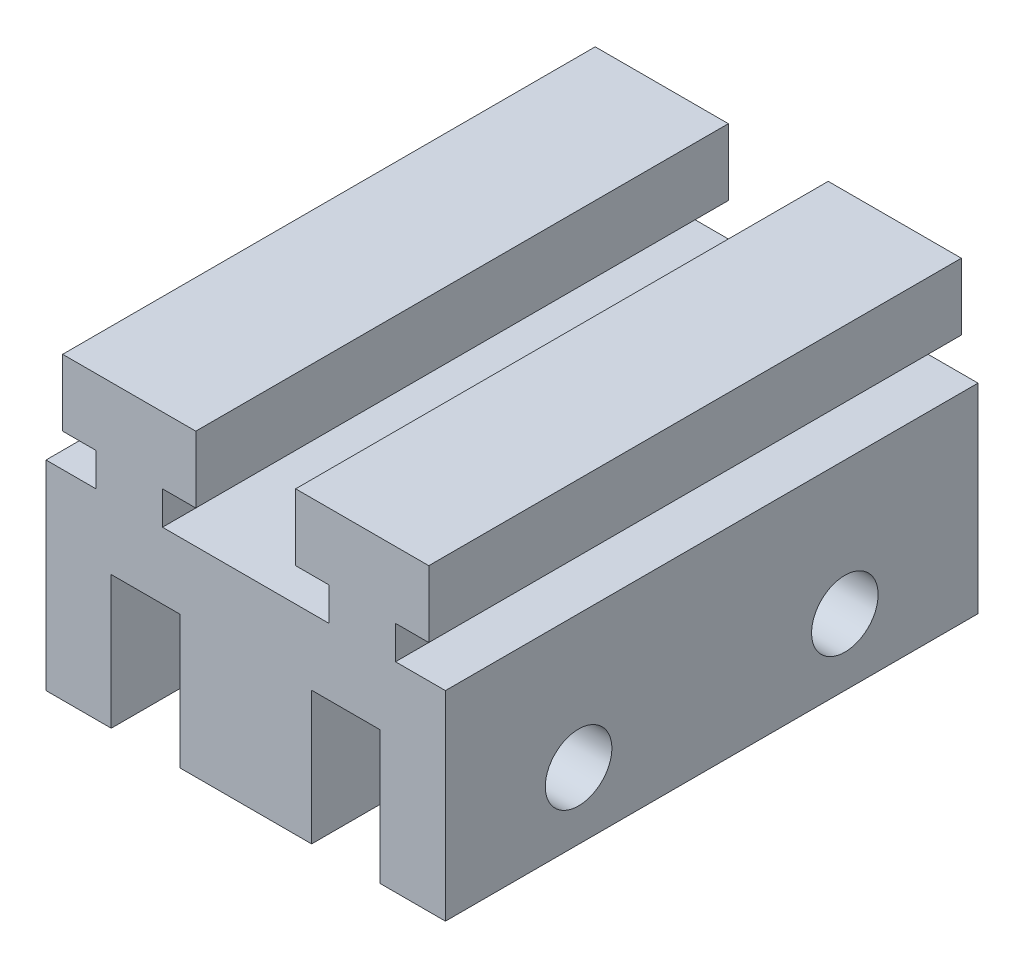
ISO-10303-21;
HEADER;
FILE_DESCRIPTION(('STEP AP214'),'2;1');
FILE_NAME('part.step','',(''),(''),'','','');
FILE_SCHEMA(('AUTOMOTIVE_DESIGN { 1 0 10303 214 1 1 1 1 }'));
ENDSEC;
DATA;
#1=APPLICATION_CONTEXT('core data for automotive mechanical design processes');
#2=APPLICATION_PROTOCOL_DEFINITION('international standard','automotive_design',2000,#1);
#3=PRODUCT_CONTEXT('',#1,'mechanical');
#4=PRODUCT('Part','Part','',(#3));
#5=PRODUCT_RELATED_PRODUCT_CATEGORY('part','',(#4));
#6=PRODUCT_DEFINITION_FORMATION('','',#4);
#7=PRODUCT_DEFINITION_CONTEXT('part definition',#1,'design');
#8=PRODUCT_DEFINITION('design','',#6,#7);
#9=PRODUCT_DEFINITION_SHAPE('','',#8);
#10=(LENGTH_UNIT() NAMED_UNIT(*) SI_UNIT(.MILLI.,.METRE.));
#11=(NAMED_UNIT(*) PLANE_ANGLE_UNIT() SI_UNIT($,.RADIAN.));
#12=(NAMED_UNIT(*) SI_UNIT($,.STERADIAN.) SOLID_ANGLE_UNIT());
#13=UNCERTAINTY_MEASURE_WITH_UNIT(LENGTH_MEASURE(1.E-05),#10,'distance_accuracy_value','');
#14=(GEOMETRIC_REPRESENTATION_CONTEXT(3) GLOBAL_UNCERTAINTY_ASSIGNED_CONTEXT((#13)) GLOBAL_UNIT_ASSIGNED_CONTEXT((#10,
#11,#12)) REPRESENTATION_CONTEXT('',''));
#15=CARTESIAN_POINT('',(0.,0.,0.));
#16=DIRECTION('',(0.,0.,1.));
#17=DIRECTION('',(1.,0.,0.));
#18=AXIS2_PLACEMENT_3D('',#15,#16,#17);
#19=CARTESIAN_POINT('',(0.,15.,0.));
#20=DIRECTION('',(0.,1.,0.));
#21=DIRECTION('',(0.,0.,1.));
#22=AXIS2_PLACEMENT_3D('',#19,#20,#21);
#23=PLANE('',#22);
#24=DIRECTION('',(-1.,0.,0.));
#25=VECTOR('',#24,1.);
#26=CARTESIAN_POINT('',(-15.,15.,-20.));
#27=LINE('',#26,#25);
#28=CARTESIAN_POINT('',(15.,15.,-20.));
#29=VERTEX_POINT('',#28);
#30=CARTESIAN_POINT('',(11.25,15.,-20.));
#31=VERTEX_POINT('',#30);
#32=EDGE_CURVE('E488',#29,#31,#27,.T.);
#33=ORIENTED_EDGE('',*,*,#32,.T.);
#34=DIRECTION('',(0.,0.,1.));
#35=VECTOR('',#34,1.);
#36=CARTESIAN_POINT('',(11.25,15.,-32.5));
#37=LINE('',#36,#35);
#38=CARTESIAN_POINT('',(11.25,15.,20.));
#39=VERTEX_POINT('',#38);
#40=EDGE_CURVE('E61',#31,#39,#37,.T.);
#41=ORIENTED_EDGE('',*,*,#40,.T.);
#42=DIRECTION('',(1.,0.,0.));
#43=VECTOR('',#42,1.);
#44=CARTESIAN_POINT('',(-15.,15.,20.));
#45=LINE('',#44,#43);
#46=CARTESIAN_POINT('',(15.,15.,20.));
#47=VERTEX_POINT('',#46);
#48=EDGE_CURVE('E257',#39,#47,#45,.T.);
#49=ORIENTED_EDGE('',*,*,#48,.T.);
#50=DIRECTION('',(0.,0.,-1.));
#51=VECTOR('',#50,1.);
#52=CARTESIAN_POINT('',(15.,15.,-20.));
#53=LINE('',#52,#51);
#54=EDGE_CURVE('E484',#47,#29,#53,.T.);
#55=ORIENTED_EDGE('',*,*,#54,.T.);
#56=EDGE_LOOP('',(#33,#41,#49,#55));
#57=FACE_BOUND('',#56,.T.);
#58=ADVANCED_FACE('F43',(#57),#23,.T.);
#59=CARTESIAN_POINT('',(-6.25,15.,20.));
#60=VERTEX_POINT('',#59);
#61=CARTESIAN_POINT('',(6.25,15.,20.));
#62=VERTEX_POINT('',#61);
#63=EDGE_CURVE('E69',#60,#62,#45,.T.);
#64=ORIENTED_EDGE('',*,*,#63,.T.);
#65=DIRECTION('',(0.,0.,1.));
#66=VECTOR('',#65,1.);
#67=CARTESIAN_POINT('',(6.25,15.,-32.5));
#68=LINE('',#67,#66);
#69=CARTESIAN_POINT('',(6.25,15.,-20.));
#70=VERTEX_POINT('',#69);
#71=EDGE_CURVE('E282',#70,#62,#68,.T.);
#72=ORIENTED_EDGE('',*,*,#71,.F.);
#73=CARTESIAN_POINT('',(-6.25,15.,-20.));
#74=VERTEX_POINT('',#73);
#75=EDGE_CURVE('E492',#70,#74,#27,.T.);
#76=ORIENTED_EDGE('',*,*,#75,.T.);
#77=DIRECTION('',(0.,0.,1.));
#78=VECTOR('',#77,1.);
#79=CARTESIAN_POINT('',(-6.25,15.,-32.5));
#80=LINE('',#79,#78);
#81=EDGE_CURVE('E352',#74,#60,#80,.T.);
#82=ORIENTED_EDGE('',*,*,#81,.T.);
#83=EDGE_LOOP('',(#64,#72,#76,#82));
#84=FACE_BOUND('',#83,.T.);
#85=ADVANCED_FACE('F569',(#84),#23,.T.);
#86=CARTESIAN_POINT('',(0.,10.,0.));
#87=DIRECTION('',(0.,1.,0.));
#88=DIRECTION('',(0.,0.,1.));
#89=AXIS2_PLACEMENT_3D('',#86,#87,#88);
#90=PLANE('',#89);
#91=DIRECTION('',(0.,0.,1.));
#92=VECTOR('',#91,1.);
#93=CARTESIAN_POINT('',(-4.95,10.,-20.));
#94=LINE('',#93,#92);
#95=CARTESIAN_POINT('',(-4.95,10.,-20.));
#96=VERTEX_POINT('',#95);
#97=CARTESIAN_POINT('',(-4.95,10.,20.));
#98=VERTEX_POINT('',#97);
#99=EDGE_CURVE('E410',#96,#98,#94,.T.);
#100=ORIENTED_EDGE('',*,*,#99,.T.);
#101=DIRECTION('',(1.,0.,0.));
#102=VECTOR('',#101,1.);
#103=CARTESIAN_POINT('',(-15.,10.,20.));
#104=LINE('',#103,#102);
#105=CARTESIAN_POINT('',(-10.1,10.,20.));
#106=VERTEX_POINT('',#105);
#107=EDGE_CURVE('E493',#106,#98,#104,.T.);
#108=ORIENTED_EDGE('',*,*,#107,.F.);
#109=DIRECTION('',(0.,0.,-1.));
#110=VECTOR('',#109,1.);
#111=CARTESIAN_POINT('',(-10.1,10.,-20.));
#112=LINE('',#111,#110);
#113=CARTESIAN_POINT('',(-10.1,10.,-20.));
#114=VERTEX_POINT('',#113);
#115=EDGE_CURVE('E515',#106,#114,#112,.T.);
#116=ORIENTED_EDGE('',*,*,#115,.T.);
#117=DIRECTION('',(-1.,0.,0.));
#118=VECTOR('',#117,1.);
#119=CARTESIAN_POINT('',(-15.,10.,-20.));
#120=LINE('',#119,#118);
#121=EDGE_CURVE('E497',#96,#114,#120,.T.);
#122=ORIENTED_EDGE('',*,*,#121,.F.);
#123=EDGE_LOOP('',(#100,#108,#116,#122));
#124=FACE_BOUND('',#123,.T.);
#125=ADVANCED_FACE('F574',(#124),#90,.F.);
#126=DIRECTION('',(0.,0.,-1.));
#127=VECTOR('',#126,1.);
#128=CARTESIAN_POINT('',(4.95,10.,-20.));
#129=LINE('',#128,#127);
#130=CARTESIAN_POINT('',(4.95,10.,20.));
#131=VERTEX_POINT('',#130);
#132=CARTESIAN_POINT('',(4.95,10.,-20.));
#133=VERTEX_POINT('',#132);
#134=EDGE_CURVE('E405',#131,#133,#129,.T.);
#135=ORIENTED_EDGE('',*,*,#134,.T.);
#136=CARTESIAN_POINT('',(10.1,10.,-20.));
#137=VERTEX_POINT('',#136);
#138=EDGE_CURVE('E480',#137,#133,#120,.T.);
#139=ORIENTED_EDGE('',*,*,#138,.F.);
#140=DIRECTION('',(0.,0.,1.));
#141=VECTOR('',#140,1.);
#142=CARTESIAN_POINT('',(10.1,10.,-20.));
#143=LINE('',#142,#141);
#144=CARTESIAN_POINT('',(10.1,10.,20.));
#145=VERTEX_POINT('',#144);
#146=EDGE_CURVE('E456',#137,#145,#143,.T.);
#147=ORIENTED_EDGE('',*,*,#146,.T.);
#148=EDGE_CURVE('E472',#131,#145,#104,.T.);
#149=ORIENTED_EDGE('',*,*,#148,.F.);
#150=EDGE_LOOP('',(#135,#139,#147,#149));
#151=FACE_BOUND('',#150,.T.);
#152=ADVANCED_FACE('F682',(#151),#90,.F.);
#153=CARTESIAN_POINT('',(-15.,10.,-20.));
#154=DIRECTION('',(1.,0.,0.));
#155=DIRECTION('',(0.,0.,-1.));
#156=AXIS2_PLACEMENT_3D('',#153,#154,#155);
#157=PLANE('',#156);
#158=CARTESIAN_POINT('',(-15.,5.,-10.));
#159=DIRECTION('',(-1.,0.,0.));
#160=DIRECTION('',(0.,0.,1.));
#161=AXIS2_PLACEMENT_3D('',#158,#159,#160);
#162=CIRCLE('',#161,2.5);
#163=CARTESIAN_POINT('',(-15.,5.,-7.5));
#164=VERTEX_POINT('',#163);
#165=EDGE_CURVE('E507',#164,#164,#162,.T.);
#166=ORIENTED_EDGE('',*,*,#165,.F.);
#167=EDGE_LOOP('',(#166));
#168=FACE_BOUND('',#167,.T.);
#169=CARTESIAN_POINT('',(-15.,5.,10.));
#170=DIRECTION('',(-1.,0.,0.));
#171=DIRECTION('',(0.,0.,1.));
#172=AXIS2_PLACEMENT_3D('',#169,#170,#171);
#173=CIRCLE('',#172,2.5);
#174=CARTESIAN_POINT('',(-15.,5.,12.5));
#175=VERTEX_POINT('',#174);
#176=EDGE_CURVE('E506',#175,#175,#173,.T.);
#177=ORIENTED_EDGE('',*,*,#176,.F.);
#178=EDGE_LOOP('',(#177));
#179=FACE_BOUND('',#178,.T.);
#180=DIRECTION('',(0.,0.,1.));
#181=VECTOR('',#180,1.);
#182=CARTESIAN_POINT('',(-15.,0.,-20.));
#183=LINE('',#182,#181);
#184=CARTESIAN_POINT('',(-15.,0.,-20.));
#185=VERTEX_POINT('',#184);
#186=CARTESIAN_POINT('',(-15.,0.,20.));
#187=VERTEX_POINT('',#186);
#188=EDGE_CURVE('E521',#185,#187,#183,.T.);
#189=ORIENTED_EDGE('',*,*,#188,.T.);
#190=DIRECTION('',(0.,-1.,0.));
#191=VECTOR('',#190,1.);
#192=CARTESIAN_POINT('',(-15.,10.,20.));
#193=LINE('',#192,#191);
#194=CARTESIAN_POINT('',(-15.,15.,20.));
#195=VERTEX_POINT('',#194);
#196=EDGE_CURVE('E11',#195,#187,#193,.T.);
#197=ORIENTED_EDGE('',*,*,#196,.F.);
#198=DIRECTION('',(0.,0.,1.));
#199=VECTOR('',#198,1.);
#200=CARTESIAN_POINT('',(-15.,15.,-20.));
#201=LINE('',#200,#199);
#202=CARTESIAN_POINT('',(-15.,15.,-20.));
#203=VERTEX_POINT('',#202);
#204=EDGE_CURVE('E476',#203,#195,#201,.T.);
#205=ORIENTED_EDGE('',*,*,#204,.F.);
#206=DIRECTION('',(0.,-1.,0.));
#207=VECTOR('',#206,1.);
#208=CARTESIAN_POINT('',(-15.,10.,-20.));
#209=LINE('',#208,#207);
#210=EDGE_CURVE('E519',#203,#185,#209,.T.);
#211=ORIENTED_EDGE('',*,*,#210,.T.);
#212=EDGE_LOOP('',(#189,#197,#205,#211));
#213=FACE_BOUND('',#212,.T.);
#214=ADVANCED_FACE('F45',(#168,#179,#213),#157,.F.);
#215=CARTESIAN_POINT('',(-15.,10.,20.));
#216=DIRECTION('',(0.,0.,-1.));
#217=DIRECTION('',(-1.,0.,0.));
#218=AXIS2_PLACEMENT_3D('',#215,#216,#217);
#219=PLANE('',#218);
#220=DIRECTION('',(1.,0.,0.));
#221=VECTOR('',#220,1.);
#222=CARTESIAN_POINT('',(-15.,0.,20.));
#223=LINE('',#222,#221);
#224=CARTESIAN_POINT('',(-10.1,0.,20.));
#225=VERTEX_POINT('',#224);
#226=EDGE_CURVE('E525',#187,#225,#223,.T.);
#227=ORIENTED_EDGE('',*,*,#226,.T.);
#228=DIRECTION('',(0.,-1.,0.));
#229=VECTOR('',#228,1.);
#230=CARTESIAN_POINT('',(-10.1,10.,20.));
#231=LINE('',#230,#229);
#232=EDGE_CURVE('E53',#106,#225,#231,.T.);
#233=ORIENTED_EDGE('',*,*,#232,.F.);
#234=ORIENTED_EDGE('',*,*,#107,.T.);
#235=DIRECTION('',(0.,-1.,0.));
#236=VECTOR('',#235,1.);
#237=CARTESIAN_POINT('',(-4.95,10.,20.));
#238=LINE('',#237,#236);
#239=CARTESIAN_POINT('',(-4.95,0.,20.));
#240=VERTEX_POINT('',#239);
#241=EDGE_CURVE('E389',#98,#240,#238,.T.);
#242=ORIENTED_EDGE('',*,*,#241,.T.);
#243=DIRECTION('',(1.,0.,0.));
#244=VECTOR('',#243,1.);
#245=CARTESIAN_POINT('',(-4.95,0.,20.));
#246=LINE('',#245,#244);
#247=CARTESIAN_POINT('',(4.95,0.,20.));
#248=VERTEX_POINT('',#247);
#249=EDGE_CURVE('E413',#240,#248,#246,.T.);
#250=ORIENTED_EDGE('',*,*,#249,.T.);
#251=DIRECTION('',(0.,-1.,0.));
#252=VECTOR('',#251,1.);
#253=CARTESIAN_POINT('',(4.95,10.,20.));
#254=LINE('',#253,#252);
#255=EDGE_CURVE('E393',#131,#248,#254,.T.);
#256=ORIENTED_EDGE('',*,*,#255,.F.);
#257=ORIENTED_EDGE('',*,*,#148,.T.);
#258=DIRECTION('',(0.,-1.,0.));
#259=VECTOR('',#258,1.);
#260=CARTESIAN_POINT('',(10.1,10.,20.));
#261=LINE('',#260,#259);
#262=CARTESIAN_POINT('',(10.1,0.,20.));
#263=VERTEX_POINT('',#262);
#264=EDGE_CURVE('E448',#145,#263,#261,.T.);
#265=ORIENTED_EDGE('',*,*,#264,.T.);
#266=DIRECTION('',(1.,0.,0.));
#267=VECTOR('',#266,1.);
#268=CARTESIAN_POINT('',(10.1,0.,20.));
#269=LINE('',#268,#267);
#270=CARTESIAN_POINT('',(15.,0.,20.));
#271=VERTEX_POINT('',#270);
#272=EDGE_CURVE('E464',#263,#271,#269,.T.);
#273=ORIENTED_EDGE('',*,*,#272,.T.);
#274=DIRECTION('',(0.,-1.,0.));
#275=VECTOR('',#274,1.);
#276=CARTESIAN_POINT('',(15.,15.,20.));
#277=LINE('',#276,#275);
#278=EDGE_CURVE('E503',#47,#271,#277,.T.);
#279=ORIENTED_EDGE('',*,*,#278,.F.);
#280=ORIENTED_EDGE('',*,*,#48,.F.);
#281=DIRECTION('',(0.,-1.,0.));
#282=VECTOR('',#281,1.);
#283=CARTESIAN_POINT('',(11.25,15.,20.));
#284=LINE('',#283,#282);
#285=CARTESIAN_POINT('',(11.25,17.5,20.));
#286=VERTEX_POINT('',#285);
#287=EDGE_CURVE('E237',#286,#39,#284,.T.);
#288=ORIENTED_EDGE('',*,*,#287,.F.);
#289=DIRECTION('',(-1.,0.,0.));
#290=VECTOR('',#289,1.);
#291=CARTESIAN_POINT('',(11.25,17.5,20.));
#292=LINE('',#291,#290);
#293=CARTESIAN_POINT('',(13.75,17.5,20.));
#294=VERTEX_POINT('',#293);
#295=EDGE_CURVE('E246',#294,#286,#292,.T.);
#296=ORIENTED_EDGE('',*,*,#295,.F.);
#297=DIRECTION('',(0.,-1.,0.));
#298=VECTOR('',#297,1.);
#299=CARTESIAN_POINT('',(13.75,17.5,20.));
#300=LINE('',#299,#298);
#301=CARTESIAN_POINT('',(13.75,22.5,20.));
#302=VERTEX_POINT('',#301);
#303=EDGE_CURVE('E253',#302,#294,#300,.T.);
#304=ORIENTED_EDGE('',*,*,#303,.F.);
#305=DIRECTION('',(1.,0.,0.));
#306=VECTOR('',#305,1.);
#307=CARTESIAN_POINT('',(13.75,22.5,20.));
#308=LINE('',#307,#306);
#309=CARTESIAN_POINT('',(3.75,22.5,20.));
#310=VERTEX_POINT('',#309);
#311=EDGE_CURVE('E266',#310,#302,#308,.T.);
#312=ORIENTED_EDGE('',*,*,#311,.F.);
#313=DIRECTION('',(0.,1.,0.));
#314=VECTOR('',#313,1.);
#315=CARTESIAN_POINT('',(3.75,22.5,20.));
#316=LINE('',#315,#314);
#317=CARTESIAN_POINT('',(3.75,17.5,20.));
#318=VERTEX_POINT('',#317);
#319=EDGE_CURVE('E270',#318,#310,#316,.T.);
#320=ORIENTED_EDGE('',*,*,#319,.F.);
#321=DIRECTION('',(-1.,0.,0.));
#322=VECTOR('',#321,1.);
#323=CARTESIAN_POINT('',(3.75,17.5,20.));
#324=LINE('',#323,#322);
#325=CARTESIAN_POINT('',(6.25,17.5,20.));
#326=VERTEX_POINT('',#325);
#327=EDGE_CURVE('E274',#326,#318,#324,.T.);
#328=ORIENTED_EDGE('',*,*,#327,.F.);
#329=DIRECTION('',(0.,1.,0.));
#330=VECTOR('',#329,1.);
#331=CARTESIAN_POINT('',(6.25,17.5,20.));
#332=LINE('',#331,#330);
#333=EDGE_CURVE('E278',#62,#326,#332,.T.);
#334=ORIENTED_EDGE('',*,*,#333,.F.);
#335=ORIENTED_EDGE('',*,*,#63,.F.);
#336=DIRECTION('',(0.,1.,0.));
#337=VECTOR('',#336,1.);
#338=CARTESIAN_POINT('',(-6.25,17.5,20.));
#339=LINE('',#338,#337);
#340=CARTESIAN_POINT('',(-6.25,17.5,20.));
#341=VERTEX_POINT('',#340);
#342=EDGE_CURVE('E324',#60,#341,#339,.T.);
#343=ORIENTED_EDGE('',*,*,#342,.T.);
#344=DIRECTION('',(1.,0.,0.));
#345=VECTOR('',#344,1.);
#346=CARTESIAN_POINT('',(-3.75,17.5,20.));
#347=LINE('',#346,#345);
#348=CARTESIAN_POINT('',(-3.75,17.5,20.));
#349=VERTEX_POINT('',#348);
#350=EDGE_CURVE('E328',#341,#349,#347,.T.);
#351=ORIENTED_EDGE('',*,*,#350,.T.);
#352=DIRECTION('',(0.,1.,0.));
#353=VECTOR('',#352,1.);
#354=CARTESIAN_POINT('',(-3.75,22.5,20.));
#355=LINE('',#354,#353);
#356=CARTESIAN_POINT('',(-3.75,22.5,20.));
#357=VERTEX_POINT('',#356);
#358=EDGE_CURVE('E332',#349,#357,#355,.T.);
#359=ORIENTED_EDGE('',*,*,#358,.T.);
#360=DIRECTION('',(-1.,0.,0.));
#361=VECTOR('',#360,1.);
#362=CARTESIAN_POINT('',(-13.75,22.5,20.));
#363=LINE('',#362,#361);
#364=CARTESIAN_POINT('',(-13.75,22.5,20.));
#365=VERTEX_POINT('',#364);
#366=EDGE_CURVE('E336',#357,#365,#363,.T.);
#367=ORIENTED_EDGE('',*,*,#366,.T.);
#368=DIRECTION('',(0.,-1.,0.));
#369=VECTOR('',#368,1.);
#370=CARTESIAN_POINT('',(-13.75,17.5,20.));
#371=LINE('',#370,#369);
#372=CARTESIAN_POINT('',(-13.75,17.5,20.));
#373=VERTEX_POINT('',#372);
#374=EDGE_CURVE('E340',#365,#373,#371,.T.);
#375=ORIENTED_EDGE('',*,*,#374,.T.);
#376=DIRECTION('',(1.,0.,0.));
#377=VECTOR('',#376,1.);
#378=CARTESIAN_POINT('',(-11.25,17.5,20.));
#379=LINE('',#378,#377);
#380=CARTESIAN_POINT('',(-11.25,17.5,20.));
#381=VERTEX_POINT('',#380);
#382=EDGE_CURVE('E344',#373,#381,#379,.T.);
#383=ORIENTED_EDGE('',*,*,#382,.T.);
#384=DIRECTION('',(0.,-1.,0.));
#385=VECTOR('',#384,1.);
#386=CARTESIAN_POINT('',(-11.25,15.,20.));
#387=LINE('',#386,#385);
#388=CARTESIAN_POINT('',(-11.25,15.,20.));
#389=VERTEX_POINT('',#388);
#390=EDGE_CURVE('E348',#381,#389,#387,.T.);
#391=ORIENTED_EDGE('',*,*,#390,.T.);
#392=EDGE_CURVE('E481',#195,#389,#45,.T.);
#393=ORIENTED_EDGE('',*,*,#392,.F.);
#394=ORIENTED_EDGE('',*,*,#196,.T.);
#395=EDGE_LOOP('',(#227,#233,#234,#242,#250,#256,#257,#265,#273,#279,#280,#288,#296,#304,#312,
#320,#328,#334,#335,#343,#351,#359,#367,#375,#383,#391,#393,#394));
#396=FACE_BOUND('',#395,.T.);
#397=ADVANCED_FACE('F255',(#396),#219,.F.);
#398=CARTESIAN_POINT('',(-10.1,10.,-20.));
#399=DIRECTION('',(-1.,0.,0.));
#400=DIRECTION('',(0.,0.,1.));
#401=AXIS2_PLACEMENT_3D('',#398,#399,#400);
#402=PLANE('',#401);
#403=CARTESIAN_POINT('',(-10.1,5.,-10.));
#404=DIRECTION('',(-1.,0.,0.));
#405=DIRECTION('',(0.,0.,1.));
#406=AXIS2_PLACEMENT_3D('',#403,#404,#405);
#407=CIRCLE('',#406,2.5);
#408=CARTESIAN_POINT('',(-10.1,5.,-7.5));
#409=VERTEX_POINT('',#408);
#410=EDGE_CURVE('E47',#409,#409,#407,.T.);
#411=ORIENTED_EDGE('',*,*,#410,.T.);
#412=EDGE_LOOP('',(#411));
#413=FACE_BOUND('',#412,.T.);
#414=CARTESIAN_POINT('',(-10.1,5.,10.));
#415=DIRECTION('',(-1.,0.,0.));
#416=DIRECTION('',(0.,0.,1.));
#417=AXIS2_PLACEMENT_3D('',#414,#415,#416);
#418=CIRCLE('',#417,2.5);
#419=CARTESIAN_POINT('',(-10.1,5.,12.5));
#420=VERTEX_POINT('',#419);
#421=EDGE_CURVE('E511',#420,#420,#418,.T.);
#422=ORIENTED_EDGE('',*,*,#421,.T.);
#423=EDGE_LOOP('',(#422));
#424=FACE_BOUND('',#423,.T.);
#425=DIRECTION('',(0.,0.,-1.));
#426=VECTOR('',#425,1.);
#427=CARTESIAN_POINT('',(-10.1,0.,-20.));
#428=LINE('',#427,#426);
#429=CARTESIAN_POINT('',(-10.1,0.,-20.));
#430=VERTEX_POINT('',#429);
#431=EDGE_CURVE('E528',#225,#430,#428,.T.);
#432=ORIENTED_EDGE('',*,*,#431,.T.);
#433=DIRECTION('',(0.,-1.,0.));
#434=VECTOR('',#433,1.);
#435=CARTESIAN_POINT('',(-10.1,10.,-20.));
#436=LINE('',#435,#434);
#437=EDGE_CURVE('E536',#114,#430,#436,.T.);
#438=ORIENTED_EDGE('',*,*,#437,.F.);
#439=ORIENTED_EDGE('',*,*,#115,.F.);
#440=ORIENTED_EDGE('',*,*,#232,.T.);
#441=EDGE_LOOP('',(#432,#438,#439,#440));
#442=FACE_BOUND('',#441,.T.);
#443=ADVANCED_FACE('F550',(#413,#424,#442),#402,.F.);
#444=CARTESIAN_POINT('',(-15.,10.,-20.));
#445=DIRECTION('',(0.,0.,1.));
#446=DIRECTION('',(1.,0.,0.));
#447=AXIS2_PLACEMENT_3D('',#444,#445,#446);
#448=PLANE('',#447);
#449=DIRECTION('',(-1.,0.,0.));
#450=VECTOR('',#449,1.);
#451=CARTESIAN_POINT('',(-15.,0.,-20.));
#452=LINE('',#451,#450);
#453=EDGE_CURVE('E520',#430,#185,#452,.T.);
#454=ORIENTED_EDGE('',*,*,#453,.T.);
#455=ORIENTED_EDGE('',*,*,#210,.F.);
#456=CARTESIAN_POINT('',(-11.25,15.,-20.));
#457=VERTEX_POINT('',#456);
#458=EDGE_CURVE('E487',#457,#203,#27,.T.);
#459=ORIENTED_EDGE('',*,*,#458,.F.);
#460=DIRECTION('',(0.,1.,0.));
#461=VECTOR('',#460,1.);
#462=CARTESIAN_POINT('',(-11.25,15.,-20.));
#463=LINE('',#462,#461);
#464=CARTESIAN_POINT('',(-11.25,17.5,-20.));
#465=VERTEX_POINT('',#464);
#466=EDGE_CURVE('E320',#457,#465,#463,.T.);
#467=ORIENTED_EDGE('',*,*,#466,.T.);
#468=DIRECTION('',(-1.,0.,0.));
#469=VECTOR('',#468,1.);
#470=CARTESIAN_POINT('',(-11.25,17.5,-20.));
#471=LINE('',#470,#469);
#472=CARTESIAN_POINT('',(-13.75,17.5,-20.));
#473=VERTEX_POINT('',#472);
#474=EDGE_CURVE('E317',#465,#473,#471,.T.);
#475=ORIENTED_EDGE('',*,*,#474,.T.);
#476=DIRECTION('',(0.,1.,0.));
#477=VECTOR('',#476,1.);
#478=CARTESIAN_POINT('',(-13.75,17.5,-20.));
#479=LINE('',#478,#477);
#480=CARTESIAN_POINT('',(-13.75,22.5,-20.));
#481=VERTEX_POINT('',#480);
#482=EDGE_CURVE('E314',#473,#481,#479,.T.);
#483=ORIENTED_EDGE('',*,*,#482,.T.);
#484=DIRECTION('',(1.,0.,0.));
#485=VECTOR('',#484,1.);
#486=CARTESIAN_POINT('',(-13.75,22.5,-20.));
#487=LINE('',#486,#485);
#488=CARTESIAN_POINT('',(-3.75,22.5,-20.));
#489=VERTEX_POINT('',#488);
#490=EDGE_CURVE('E311',#481,#489,#487,.T.);
#491=ORIENTED_EDGE('',*,*,#490,.T.);
#492=DIRECTION('',(0.,-1.,0.));
#493=VECTOR('',#492,1.);
#494=CARTESIAN_POINT('',(-3.75,22.5,-20.));
#495=LINE('',#494,#493);
#496=CARTESIAN_POINT('',(-3.75,17.5,-20.));
#497=VERTEX_POINT('',#496);
#498=EDGE_CURVE('E307',#489,#497,#495,.T.);
#499=ORIENTED_EDGE('',*,*,#498,.T.);
#500=DIRECTION('',(-1.,0.,0.));
#501=VECTOR('',#500,1.);
#502=CARTESIAN_POINT('',(-3.75,17.5,-20.));
#503=LINE('',#502,#501);
#504=CARTESIAN_POINT('',(-6.25,17.5,-20.));
#505=VERTEX_POINT('',#504);
#506=EDGE_CURVE('E304',#497,#505,#503,.T.);
#507=ORIENTED_EDGE('',*,*,#506,.T.);
#508=DIRECTION('',(0.,-1.,0.));
#509=VECTOR('',#508,1.);
#510=CARTESIAN_POINT('',(-6.25,17.5,-20.));
#511=LINE('',#510,#509);
#512=EDGE_CURVE('E323',#505,#74,#511,.T.);
#513=ORIENTED_EDGE('',*,*,#512,.T.);
#514=ORIENTED_EDGE('',*,*,#75,.F.);
#515=DIRECTION('',(0.,-1.,0.));
#516=VECTOR('',#515,1.);
#517=CARTESIAN_POINT('',(6.25,17.5,-20.));
#518=LINE('',#517,#516);
#519=CARTESIAN_POINT('',(6.25,17.5,-20.));
#520=VERTEX_POINT('',#519);
#521=EDGE_CURVE('E261',#520,#70,#518,.T.);
#522=ORIENTED_EDGE('',*,*,#521,.F.);
#523=DIRECTION('',(1.,0.,0.));
#524=VECTOR('',#523,1.);
#525=CARTESIAN_POINT('',(3.75,17.5,-20.));
#526=LINE('',#525,#524);
#527=CARTESIAN_POINT('',(3.75,17.5,-20.));
#528=VERTEX_POINT('',#527);
#529=EDGE_CURVE('E636',#528,#520,#526,.T.);
#530=ORIENTED_EDGE('',*,*,#529,.F.);
#531=DIRECTION('',(0.,-1.,0.));
#532=VECTOR('',#531,1.);
#533=CARTESIAN_POINT('',(3.75,22.5,-20.));
#534=LINE('',#533,#532);
#535=CARTESIAN_POINT('',(3.75,22.5,-20.));
#536=VERTEX_POINT('',#535);
#537=EDGE_CURVE('E638',#536,#528,#534,.T.);
#538=ORIENTED_EDGE('',*,*,#537,.F.);
#539=DIRECTION('',(-1.,0.,0.));
#540=VECTOR('',#539,1.);
#541=CARTESIAN_POINT('',(13.75,22.5,-20.));
#542=LINE('',#541,#540);
#543=CARTESIAN_POINT('',(13.75,22.5,-20.));
#544=VERTEX_POINT('',#543);
#545=EDGE_CURVE('E643',#544,#536,#542,.T.);
#546=ORIENTED_EDGE('',*,*,#545,.F.);
#547=DIRECTION('',(0.,1.,0.));
#548=VECTOR('',#547,1.);
#549=CARTESIAN_POINT('',(13.75,17.5,-20.));
#550=LINE('',#549,#548);
#551=CARTESIAN_POINT('',(13.75,17.5,-20.));
#552=VERTEX_POINT('',#551);
#553=EDGE_CURVE('E649',#552,#544,#550,.T.);
#554=ORIENTED_EDGE('',*,*,#553,.F.);
#555=DIRECTION('',(1.,0.,0.));
#556=VECTOR('',#555,1.);
#557=CARTESIAN_POINT('',(11.25,17.5,-20.));
#558=LINE('',#557,#556);
#559=CARTESIAN_POINT('',(11.25,17.5,-20.));
#560=VERTEX_POINT('',#559);
#561=EDGE_CURVE('E303',#560,#552,#558,.T.);
#562=ORIENTED_EDGE('',*,*,#561,.F.);
#563=DIRECTION('',(0.,1.,0.));
#564=VECTOR('',#563,1.);
#565=CARTESIAN_POINT('',(11.25,15.,-20.));
#566=LINE('',#565,#564);
#567=EDGE_CURVE('E239',#31,#560,#566,.T.);
#568=ORIENTED_EDGE('',*,*,#567,.F.);
#569=ORIENTED_EDGE('',*,*,#32,.F.);
#570=DIRECTION('',(0.,-1.,0.));
#571=VECTOR('',#570,1.);
#572=CARTESIAN_POINT('',(15.,15.,-20.));
#573=LINE('',#572,#571);
#574=CARTESIAN_POINT('',(15.,0.,-20.));
#575=VERTEX_POINT('',#574);
#576=EDGE_CURVE('E491',#29,#575,#573,.T.);
#577=ORIENTED_EDGE('',*,*,#576,.T.);
#578=DIRECTION('',(-1.,0.,0.));
#579=VECTOR('',#578,1.);
#580=CARTESIAN_POINT('',(10.1,0.,-20.));
#581=LINE('',#580,#579);
#582=CARTESIAN_POINT('',(10.1,0.,-20.));
#583=VERTEX_POINT('',#582);
#584=EDGE_CURVE('E457',#575,#583,#581,.T.);
#585=ORIENTED_EDGE('',*,*,#584,.T.);
#586=DIRECTION('',(0.,-1.,0.));
#587=VECTOR('',#586,1.);
#588=CARTESIAN_POINT('',(10.1,10.,-20.));
#589=LINE('',#588,#587);
#590=EDGE_CURVE('E452',#137,#583,#589,.T.);
#591=ORIENTED_EDGE('',*,*,#590,.F.);
#592=ORIENTED_EDGE('',*,*,#138,.T.);
#593=DIRECTION('',(0.,-1.,0.));
#594=VECTOR('',#593,1.);
#595=CARTESIAN_POINT('',(4.95,10.,-20.));
#596=LINE('',#595,#594);
#597=CARTESIAN_POINT('',(4.95,0.,-20.));
#598=VERTEX_POINT('',#597);
#599=EDGE_CURVE('E397',#133,#598,#596,.T.);
#600=ORIENTED_EDGE('',*,*,#599,.T.);
#601=DIRECTION('',(-1.,0.,0.));
#602=VECTOR('',#601,1.);
#603=CARTESIAN_POINT('',(-4.95,0.,-20.));
#604=LINE('',#603,#602);
#605=CARTESIAN_POINT('',(-4.95,0.,-20.));
#606=VERTEX_POINT('',#605);
#607=EDGE_CURVE('E406',#598,#606,#604,.T.);
#608=ORIENTED_EDGE('',*,*,#607,.T.);
#609=DIRECTION('',(0.,-1.,0.));
#610=VECTOR('',#609,1.);
#611=CARTESIAN_POINT('',(-4.95,10.,-20.));
#612=LINE('',#611,#610);
#613=EDGE_CURVE('E401',#96,#606,#612,.T.);
#614=ORIENTED_EDGE('',*,*,#613,.F.);
#615=ORIENTED_EDGE('',*,*,#121,.T.);
#616=ORIENTED_EDGE('',*,*,#437,.T.);
#617=EDGE_LOOP('',(#454,#455,#459,#467,#475,#483,#491,#499,#507,#513,#514,#522,#530,#538,#546,
#554,#562,#568,#569,#577,#585,#591,#592,#600,#608,#614,#615,#616));
#618=FACE_BOUND('',#617,.T.);
#619=ADVANCED_FACE('F593',(#618),#448,.F.);
#620=CARTESIAN_POINT('',(0.,0.,0.));
#621=DIRECTION('',(0.,1.,0.));
#622=DIRECTION('',(0.,0.,1.));
#623=AXIS2_PLACEMENT_3D('',#620,#621,#622);
#624=PLANE('',#623);
#625=ORIENTED_EDGE('',*,*,#188,.F.);
#626=ORIENTED_EDGE('',*,*,#453,.F.);
#627=ORIENTED_EDGE('',*,*,#431,.F.);
#628=ORIENTED_EDGE('',*,*,#226,.F.);
#629=EDGE_LOOP('',(#625,#626,#627,#628));
#630=FACE_BOUND('',#629,.T.);
#631=ADVANCED_FACE('F565',(#630),#624,.F.);
#632=CARTESIAN_POINT('',(22.0710678118655,5.,10.));
#633=DIRECTION('',(-1.,0.,0.));
#634=DIRECTION('',(0.,0.,1.));
#635=AXIS2_PLACEMENT_3D('',#632,#633,#634);
#636=CYLINDRICAL_SURFACE('',#635,2.5);
#637=ORIENTED_EDGE('',*,*,#176,.T.);
#638=EDGE_LOOP('',(#637));
#639=FACE_BOUND('',#638,.T.);
#640=ORIENTED_EDGE('',*,*,#421,.F.);
#641=EDGE_LOOP('',(#640));
#642=FACE_BOUND('',#641,.T.);
#643=ADVANCED_FACE('F555',(#639,#642),#636,.F.);
#644=CARTESIAN_POINT('',(22.0710678118655,5.,-10.));
#645=DIRECTION('',(-1.,0.,0.));
#646=DIRECTION('',(0.,0.,1.));
#647=AXIS2_PLACEMENT_3D('',#644,#645,#646);
#648=CYLINDRICAL_SURFACE('',#647,2.5);
#649=ORIENTED_EDGE('',*,*,#165,.T.);
#650=EDGE_LOOP('',(#649));
#651=FACE_BOUND('',#650,.T.);
#652=ORIENTED_EDGE('',*,*,#410,.F.);
#653=EDGE_LOOP('',(#652));
#654=FACE_BOUND('',#653,.T.);
#655=ADVANCED_FACE('F552',(#651,#654),#648,.F.);
#656=CARTESIAN_POINT('',(15.,15.,-20.));
#657=DIRECTION('',(-1.,0.,0.));
#658=DIRECTION('',(0.,0.,1.));
#659=AXIS2_PLACEMENT_3D('',#656,#657,#658);
#660=PLANE('',#659);
#661=ORIENTED_EDGE('',*,*,#278,.T.);
#662=DIRECTION('',(0.,0.,-1.));
#663=VECTOR('',#662,1.);
#664=CARTESIAN_POINT('',(15.,0.,-20.));
#665=LINE('',#664,#663);
#666=EDGE_CURVE('E460',#271,#575,#665,.T.);
#667=ORIENTED_EDGE('',*,*,#666,.T.);
#668=ORIENTED_EDGE('',*,*,#576,.F.);
#669=ORIENTED_EDGE('',*,*,#54,.F.);
#670=EDGE_LOOP('',(#661,#667,#668,#669));
#671=FACE_BOUND('',#670,.T.);
#672=CARTESIAN_POINT('',(15.,5.,-10.));
#673=DIRECTION('',(-1.,0.,0.));
#674=DIRECTION('',(0.,0.,1.));
#675=AXIS2_PLACEMENT_3D('',#672,#673,#674);
#676=CIRCLE('',#675,2.5);
#677=CARTESIAN_POINT('',(15.,5.,-7.5));
#678=VERTEX_POINT('',#677);
#679=EDGE_CURVE('E433',#678,#678,#676,.F.);
#680=ORIENTED_EDGE('',*,*,#679,.F.);
#681=EDGE_LOOP('',(#680));
#682=FACE_BOUND('',#681,.T.);
#683=CARTESIAN_POINT('',(15.,5.,10.));
#684=DIRECTION('',(-1.,0.,0.));
#685=DIRECTION('',(0.,0.,1.));
#686=AXIS2_PLACEMENT_3D('',#683,#684,#685);
#687=CIRCLE('',#686,2.5);
#688=CARTESIAN_POINT('',(15.,5.,12.5));
#689=VERTEX_POINT('',#688);
#690=EDGE_CURVE('E420',#689,#689,#687,.F.);
#691=ORIENTED_EDGE('',*,*,#690,.F.);
#692=EDGE_LOOP('',(#691));
#693=FACE_BOUND('',#692,.T.);
#694=ADVANCED_FACE('F554',(#671,#682,#693),#660,.F.);
#695=DIRECTION('',(0.,0.,1.));
#696=VECTOR('',#695,1.);
#697=CARTESIAN_POINT('',(-11.25,15.,-32.5));
#698=LINE('',#697,#696);
#699=EDGE_CURVE('E308',#457,#389,#698,.T.);
#700=ORIENTED_EDGE('',*,*,#699,.F.);
#701=ORIENTED_EDGE('',*,*,#458,.T.);
#702=ORIENTED_EDGE('',*,*,#204,.T.);
#703=ORIENTED_EDGE('',*,*,#392,.T.);
#704=EDGE_LOOP('',(#700,#701,#702,#703));
#705=FACE_BOUND('',#704,.T.);
#706=ADVANCED_FACE('F562',(#705),#23,.T.);
#707=CARTESIAN_POINT('',(10.1,10.,-20.));
#708=DIRECTION('',(1.,0.,0.));
#709=DIRECTION('',(0.,0.,-1.));
#710=AXIS2_PLACEMENT_3D('',#707,#708,#709);
#711=PLANE('',#710);
#712=CARTESIAN_POINT('',(10.1,5.,-10.));
#713=DIRECTION('',(1.,0.,0.));
#714=DIRECTION('',(0.,0.,-1.));
#715=AXIS2_PLACEMENT_3D('',#712,#713,#714);
#716=CIRCLE('',#715,2.5);
#717=CARTESIAN_POINT('',(10.1,5.,-12.5));
#718=VERTEX_POINT('',#717);
#719=EDGE_CURVE('E444',#718,#718,#716,.T.);
#720=ORIENTED_EDGE('',*,*,#719,.T.);
#721=EDGE_LOOP('',(#720));
#722=FACE_BOUND('',#721,.T.);
#723=CARTESIAN_POINT('',(10.1,5.,10.));
#724=DIRECTION('',(1.,0.,0.));
#725=DIRECTION('',(0.,0.,-1.));
#726=AXIS2_PLACEMENT_3D('',#723,#724,#725);
#727=CIRCLE('',#726,2.5);
#728=CARTESIAN_POINT('',(10.1,5.,7.5));
#729=VERTEX_POINT('',#728);
#730=EDGE_CURVE('E437',#729,#729,#727,.T.);
#731=ORIENTED_EDGE('',*,*,#730,.T.);
#732=EDGE_LOOP('',(#731));
#733=FACE_BOUND('',#732,.T.);
#734=DIRECTION('',(0.,0.,1.));
#735=VECTOR('',#734,1.);
#736=CARTESIAN_POINT('',(10.1,0.,-20.));
#737=LINE('',#736,#735);
#738=EDGE_CURVE('E468',#583,#263,#737,.T.);
#739=ORIENTED_EDGE('',*,*,#738,.T.);
#740=ORIENTED_EDGE('',*,*,#264,.F.);
#741=ORIENTED_EDGE('',*,*,#146,.F.);
#742=ORIENTED_EDGE('',*,*,#590,.T.);
#743=EDGE_LOOP('',(#739,#740,#741,#742));
#744=FACE_BOUND('',#743,.T.);
#745=ADVANCED_FACE('F578',(#722,#733,#744),#711,.F.);
#746=CARTESIAN_POINT('',(0.,0.,0.));
#747=DIRECTION('',(0.,1.,0.));
#748=DIRECTION('',(0.,0.,1.));
#749=AXIS2_PLACEMENT_3D('',#746,#747,#748);
#750=PLANE('',#749);
#751=ORIENTED_EDGE('',*,*,#738,.F.);
#752=ORIENTED_EDGE('',*,*,#584,.F.);
#753=ORIENTED_EDGE('',*,*,#666,.F.);
#754=ORIENTED_EDGE('',*,*,#272,.F.);
#755=EDGE_LOOP('',(#751,#752,#753,#754));
#756=FACE_BOUND('',#755,.T.);
#757=ADVANCED_FACE('F583',(#756),#750,.F.);
#758=CARTESIAN_POINT('',(22.0710678118655,5.,10.));
#759=DIRECTION('',(-1.,0.,0.));
#760=DIRECTION('',(0.,0.,1.));
#761=AXIS2_PLACEMENT_3D('',#758,#759,#760);
#762=CYLINDRICAL_SURFACE('',#761,2.5);
#763=ORIENTED_EDGE('',*,*,#690,.T.);
#764=EDGE_LOOP('',(#763));
#765=FACE_BOUND('',#764,.T.);
#766=ORIENTED_EDGE('',*,*,#730,.F.);
#767=EDGE_LOOP('',(#766));
#768=FACE_BOUND('',#767,.T.);
#769=ADVANCED_FACE('F724',(#765,#768),#762,.F.);
#770=CARTESIAN_POINT('',(22.0710678118655,5.,-10.));
#771=DIRECTION('',(-1.,0.,0.));
#772=DIRECTION('',(0.,0.,1.));
#773=AXIS2_PLACEMENT_3D('',#770,#771,#772);
#774=CYLINDRICAL_SURFACE('',#773,2.5);
#775=ORIENTED_EDGE('',*,*,#679,.T.);
#776=EDGE_LOOP('',(#775));
#777=FACE_BOUND('',#776,.T.);
#778=ORIENTED_EDGE('',*,*,#719,.F.);
#779=EDGE_LOOP('',(#778));
#780=FACE_BOUND('',#779,.T.);
#781=ADVANCED_FACE('F716',(#777,#780),#774,.F.);
#782=CARTESIAN_POINT('',(-4.95,10.,-20.));
#783=DIRECTION('',(1.,0.,0.));
#784=DIRECTION('',(0.,0.,-1.));
#785=AXIS2_PLACEMENT_3D('',#782,#783,#784);
#786=PLANE('',#785);
#787=CARTESIAN_POINT('',(-4.95,5.,-10.));
#788=DIRECTION('',(1.,0.,0.));
#789=DIRECTION('',(0.,0.,-1.));
#790=AXIS2_PLACEMENT_3D('',#787,#788,#789);
#791=CIRCLE('',#790,2.5);
#792=CARTESIAN_POINT('',(-4.95,5.,-12.5));
#793=VERTEX_POINT('',#792);
#794=EDGE_CURVE('E385',#793,#793,#791,.T.);
#795=ORIENTED_EDGE('',*,*,#794,.T.);
#796=EDGE_LOOP('',(#795));
#797=FACE_BOUND('',#796,.T.);
#798=CARTESIAN_POINT('',(-4.95,5.,10.));
#799=DIRECTION('',(1.,0.,0.));
#800=DIRECTION('',(0.,0.,-1.));
#801=AXIS2_PLACEMENT_3D('',#798,#799,#800);
#802=CIRCLE('',#801,2.5);
#803=CARTESIAN_POINT('',(-4.95,5.,7.5));
#804=VERTEX_POINT('',#803);
#805=EDGE_CURVE('E380',#804,#804,#802,.T.);
#806=ORIENTED_EDGE('',*,*,#805,.T.);
#807=EDGE_LOOP('',(#806));
#808=FACE_BOUND('',#807,.T.);
#809=DIRECTION('',(0.,0.,1.));
#810=VECTOR('',#809,1.);
#811=CARTESIAN_POINT('',(-4.95,0.,-20.));
#812=LINE('',#811,#810);
#813=EDGE_CURVE('E416',#606,#240,#812,.T.);
#814=ORIENTED_EDGE('',*,*,#813,.T.);
#815=ORIENTED_EDGE('',*,*,#241,.F.);
#816=ORIENTED_EDGE('',*,*,#99,.F.);
#817=ORIENTED_EDGE('',*,*,#613,.T.);
#818=EDGE_LOOP('',(#814,#815,#816,#817));
#819=FACE_BOUND('',#818,.T.);
#820=ADVANCED_FACE('F692',(#797,#808,#819),#786,.F.);
#821=CARTESIAN_POINT('',(4.95,10.,-20.));
#822=DIRECTION('',(-1.,0.,0.));
#823=DIRECTION('',(0.,0.,1.));
#824=AXIS2_PLACEMENT_3D('',#821,#822,#823);
#825=PLANE('',#824);
#826=CARTESIAN_POINT('',(4.95,5.,-10.));
#827=DIRECTION('',(-1.,0.,0.));
#828=DIRECTION('',(0.,0.,1.));
#829=AXIS2_PLACEMENT_3D('',#826,#827,#828);
#830=CIRCLE('',#829,2.5);
#831=CARTESIAN_POINT('',(4.95,5.,-7.5));
#832=VERTEX_POINT('',#831);
#833=EDGE_CURVE('E384',#832,#832,#830,.T.);
#834=ORIENTED_EDGE('',*,*,#833,.T.);
#835=EDGE_LOOP('',(#834));
#836=FACE_BOUND('',#835,.T.);
#837=CARTESIAN_POINT('',(4.95,5.,10.));
#838=DIRECTION('',(-1.,0.,0.));
#839=DIRECTION('',(0.,0.,1.));
#840=AXIS2_PLACEMENT_3D('',#837,#838,#839);
#841=CIRCLE('',#840,2.5);
#842=CARTESIAN_POINT('',(4.95,5.,12.5));
#843=VERTEX_POINT('',#842);
#844=EDGE_CURVE('E379',#843,#843,#841,.T.);
#845=ORIENTED_EDGE('',*,*,#844,.T.);
#846=EDGE_LOOP('',(#845));
#847=FACE_BOUND('',#846,.T.);
#848=DIRECTION('',(0.,0.,-1.));
#849=VECTOR('',#848,1.);
#850=CARTESIAN_POINT('',(4.95,0.,-20.));
#851=LINE('',#850,#849);
#852=EDGE_CURVE('E409',#248,#598,#851,.T.);
#853=ORIENTED_EDGE('',*,*,#852,.T.);
#854=ORIENTED_EDGE('',*,*,#599,.F.);
#855=ORIENTED_EDGE('',*,*,#134,.F.);
#856=ORIENTED_EDGE('',*,*,#255,.T.);
#857=EDGE_LOOP('',(#853,#854,#855,#856));
#858=FACE_BOUND('',#857,.T.);
#859=ADVANCED_FACE('F706',(#836,#847,#858),#825,.F.);
#860=CARTESIAN_POINT('',(0.,0.,0.));
#861=DIRECTION('',(0.,1.,0.));
#862=DIRECTION('',(0.,0.,1.));
#863=AXIS2_PLACEMENT_3D('',#860,#861,#862);
#864=PLANE('',#863);
#865=ORIENTED_EDGE('',*,*,#813,.F.);
#866=ORIENTED_EDGE('',*,*,#607,.F.);
#867=ORIENTED_EDGE('',*,*,#852,.F.);
#868=ORIENTED_EDGE('',*,*,#249,.F.);
#869=EDGE_LOOP('',(#865,#866,#867,#868));
#870=FACE_BOUND('',#869,.T.);
#871=ADVANCED_FACE('F690',(#870),#864,.F.);
#872=CARTESIAN_POINT('',(22.0710678118655,5.,10.));
#873=DIRECTION('',(-1.,0.,0.));
#874=DIRECTION('',(0.,0.,1.));
#875=AXIS2_PLACEMENT_3D('',#872,#873,#874);
#876=CYLINDRICAL_SURFACE('',#875,2.5);
#877=ORIENTED_EDGE('',*,*,#844,.F.);
#878=EDGE_LOOP('',(#877));
#879=FACE_BOUND('',#878,.T.);
#880=ORIENTED_EDGE('',*,*,#805,.F.);
#881=EDGE_LOOP('',(#880));
#882=FACE_BOUND('',#881,.T.);
#883=ADVANCED_FACE('F714',(#879,#882),#876,.F.);
#884=CARTESIAN_POINT('',(22.0710678118655,5.,-10.));
#885=DIRECTION('',(-1.,0.,0.));
#886=DIRECTION('',(0.,0.,1.));
#887=AXIS2_PLACEMENT_3D('',#884,#885,#886);
#888=CYLINDRICAL_SURFACE('',#887,2.5);
#889=ORIENTED_EDGE('',*,*,#833,.F.);
#890=EDGE_LOOP('',(#889));
#891=FACE_BOUND('',#890,.T.);
#892=ORIENTED_EDGE('',*,*,#794,.F.);
#893=EDGE_LOOP('',(#892));
#894=FACE_BOUND('',#893,.T.);
#895=ADVANCED_FACE('F765',(#891,#894),#888,.F.);
#896=CARTESIAN_POINT('',(-11.25,15.,-32.5));
#897=DIRECTION('',(-1.,0.,0.));
#898=DIRECTION('',(0.,0.,1.));
#899=AXIS2_PLACEMENT_3D('',#896,#897,#898);
#900=PLANE('',#899);
#901=ORIENTED_EDGE('',*,*,#466,.F.);
#902=ORIENTED_EDGE('',*,*,#699,.T.);
#903=ORIENTED_EDGE('',*,*,#390,.F.);
#904=DIRECTION('',(0.,0.,1.));
#905=VECTOR('',#904,1.);
#906=CARTESIAN_POINT('',(-11.25,17.5,-32.5));
#907=LINE('',#906,#905);
#908=EDGE_CURVE('E356',#465,#381,#907,.T.);
#909=ORIENTED_EDGE('',*,*,#908,.F.);
#910=EDGE_LOOP('',(#901,#902,#903,#909));
#911=FACE_BOUND('',#910,.T.);
#912=ADVANCED_FACE('F598',(#911),#900,.T.);
#913=CARTESIAN_POINT('',(-11.25,17.5,-32.5));
#914=DIRECTION('',(0.,-1.,0.));
#915=DIRECTION('',(0.,0.,-1.));
#916=AXIS2_PLACEMENT_3D('',#913,#914,#915);
#917=PLANE('',#916);
#918=ORIENTED_EDGE('',*,*,#474,.F.);
#919=ORIENTED_EDGE('',*,*,#908,.T.);
#920=ORIENTED_EDGE('',*,*,#382,.F.);
#921=DIRECTION('',(0.,0.,1.));
#922=VECTOR('',#921,1.);
#923=CARTESIAN_POINT('',(-13.75,17.5,-32.5));
#924=LINE('',#923,#922);
#925=EDGE_CURVE('E359',#473,#373,#924,.T.);
#926=ORIENTED_EDGE('',*,*,#925,.F.);
#927=EDGE_LOOP('',(#918,#919,#920,#926));
#928=FACE_BOUND('',#927,.T.);
#929=ADVANCED_FACE('F601',(#928),#917,.T.);
#930=CARTESIAN_POINT('',(-13.75,17.5,-32.5));
#931=DIRECTION('',(-1.,0.,0.));
#932=DIRECTION('',(0.,-1.,0.));
#933=AXIS2_PLACEMENT_3D('',#930,#931,#932);
#934=PLANE('',#933);
#935=ORIENTED_EDGE('',*,*,#482,.F.);
#936=ORIENTED_EDGE('',*,*,#925,.T.);
#937=ORIENTED_EDGE('',*,*,#374,.F.);
#938=DIRECTION('',(0.,0.,1.));
#939=VECTOR('',#938,1.);
#940=CARTESIAN_POINT('',(-13.75,22.5,-32.5));
#941=LINE('',#940,#939);
#942=EDGE_CURVE('E362',#481,#365,#941,.T.);
#943=ORIENTED_EDGE('',*,*,#942,.F.);
#944=EDGE_LOOP('',(#935,#936,#937,#943));
#945=FACE_BOUND('',#944,.T.);
#946=ADVANCED_FACE('F608',(#945),#934,.T.);
#947=CARTESIAN_POINT('',(-13.75,22.5,-32.5));
#948=DIRECTION('',(0.,1.,0.));
#949=DIRECTION('',(-1.,0.,0.));
#950=AXIS2_PLACEMENT_3D('',#947,#948,#949);
#951=PLANE('',#950);
#952=ORIENTED_EDGE('',*,*,#490,.F.);
#953=ORIENTED_EDGE('',*,*,#942,.T.);
#954=ORIENTED_EDGE('',*,*,#366,.F.);
#955=DIRECTION('',(0.,0.,1.));
#956=VECTOR('',#955,1.);
#957=CARTESIAN_POINT('',(-3.75,22.5,-32.5));
#958=LINE('',#957,#956);
#959=EDGE_CURVE('E365',#489,#357,#958,.T.);
#960=ORIENTED_EDGE('',*,*,#959,.F.);
#961=EDGE_LOOP('',(#952,#953,#954,#960));
#962=FACE_BOUND('',#961,.T.);
#963=ADVANCED_FACE('F613',(#962),#951,.T.);
#964=CARTESIAN_POINT('',(-3.75,22.5,-32.5));
#965=DIRECTION('',(1.,0.,0.));
#966=DIRECTION('',(0.,1.,0.));
#967=AXIS2_PLACEMENT_3D('',#964,#965,#966);
#968=PLANE('',#967);
#969=ORIENTED_EDGE('',*,*,#498,.F.);
#970=ORIENTED_EDGE('',*,*,#959,.T.);
#971=ORIENTED_EDGE('',*,*,#358,.F.);
#972=DIRECTION('',(0.,0.,1.));
#973=VECTOR('',#972,1.);
#974=CARTESIAN_POINT('',(-3.75,17.5,-32.5));
#975=LINE('',#974,#973);
#976=EDGE_CURVE('E368',#497,#349,#975,.T.);
#977=ORIENTED_EDGE('',*,*,#976,.F.);
#978=EDGE_LOOP('',(#969,#970,#971,#977));
#979=FACE_BOUND('',#978,.T.);
#980=ADVANCED_FACE('F616',(#979),#968,.T.);
#981=CARTESIAN_POINT('',(-3.75,17.5,-32.5));
#982=DIRECTION('',(0.,-1.,0.));
#983=DIRECTION('',(1.,0.,0.));
#984=AXIS2_PLACEMENT_3D('',#981,#982,#983);
#985=PLANE('',#984);
#986=ORIENTED_EDGE('',*,*,#506,.F.);
#987=ORIENTED_EDGE('',*,*,#976,.T.);
#988=ORIENTED_EDGE('',*,*,#350,.F.);
#989=DIRECTION('',(0.,0.,1.));
#990=VECTOR('',#989,1.);
#991=CARTESIAN_POINT('',(-6.25,17.5,-32.5));
#992=LINE('',#991,#990);
#993=EDGE_CURVE('E371',#505,#341,#992,.T.);
#994=ORIENTED_EDGE('',*,*,#993,.F.);
#995=EDGE_LOOP('',(#986,#987,#988,#994));
#996=FACE_BOUND('',#995,.T.);
#997=ADVANCED_FACE('F621',(#996),#985,.T.);
#998=CARTESIAN_POINT('',(-6.25,17.5,-32.5));
#999=DIRECTION('',(1.,0.,0.));
#1000=DIRECTION('',(0.,1.,0.));
#1001=AXIS2_PLACEMENT_3D('',#998,#999,#1000);
#1002=PLANE('',#1001);
#1003=ORIENTED_EDGE('',*,*,#512,.F.);
#1004=ORIENTED_EDGE('',*,*,#993,.T.);
#1005=ORIENTED_EDGE('',*,*,#342,.F.);
#1006=ORIENTED_EDGE('',*,*,#81,.F.);
#1007=EDGE_LOOP('',(#1003,#1004,#1005,#1006));
#1008=FACE_BOUND('',#1007,.T.);
#1009=ADVANCED_FACE('F627',(#1008),#1002,.T.);
#1010=CARTESIAN_POINT('',(11.25,15.,-32.5));
#1011=DIRECTION('',(-1.,0.,0.));
#1012=DIRECTION('',(0.,0.,1.));
#1013=AXIS2_PLACEMENT_3D('',#1010,#1011,#1012);
#1014=PLANE('',#1013);
#1015=ORIENTED_EDGE('',*,*,#40,.F.);
#1016=ORIENTED_EDGE('',*,*,#567,.T.);
#1017=DIRECTION('',(0.,0.,1.));
#1018=VECTOR('',#1017,1.);
#1019=CARTESIAN_POINT('',(11.25,17.5,-32.5));
#1020=LINE('',#1019,#1018);
#1021=EDGE_CURVE('E233',#560,#286,#1020,.T.);
#1022=ORIENTED_EDGE('',*,*,#1021,.T.);
#1023=ORIENTED_EDGE('',*,*,#287,.T.);
#1024=EDGE_LOOP('',(#1015,#1016,#1022,#1023));
#1025=FACE_BOUND('',#1024,.T.);
#1026=ADVANCED_FACE('F235',(#1025),#1014,.F.);
#1027=CARTESIAN_POINT('',(11.25,17.5,-32.5));
#1028=DIRECTION('',(0.,1.,0.));
#1029=DIRECTION('',(0.,0.,1.));
#1030=AXIS2_PLACEMENT_3D('',#1027,#1028,#1029);
#1031=PLANE('',#1030);
#1032=ORIENTED_EDGE('',*,*,#1021,.F.);
#1033=ORIENTED_EDGE('',*,*,#561,.T.);
#1034=DIRECTION('',(0.,0.,1.));
#1035=VECTOR('',#1034,1.);
#1036=CARTESIAN_POINT('',(13.75,17.5,-32.5));
#1037=LINE('',#1036,#1035);
#1038=EDGE_CURVE('E243',#552,#294,#1037,.T.);
#1039=ORIENTED_EDGE('',*,*,#1038,.T.);
#1040=ORIENTED_EDGE('',*,*,#295,.T.);
#1041=EDGE_LOOP('',(#1032,#1033,#1039,#1040));
#1042=FACE_BOUND('',#1041,.T.);
#1043=ADVANCED_FACE('F247',(#1042),#1031,.F.);
#1044=CARTESIAN_POINT('',(13.75,17.5,-32.5));
#1045=DIRECTION('',(-1.,0.,0.));
#1046=DIRECTION('',(0.,-1.,0.));
#1047=AXIS2_PLACEMENT_3D('',#1044,#1045,#1046);
#1048=PLANE('',#1047);
#1049=ORIENTED_EDGE('',*,*,#1038,.F.);
#1050=ORIENTED_EDGE('',*,*,#553,.T.);
#1051=DIRECTION('',(0.,0.,1.));
#1052=VECTOR('',#1051,1.);
#1053=CARTESIAN_POINT('',(13.75,22.5,-32.5));
#1054=LINE('',#1053,#1052);
#1055=EDGE_CURVE('E294',#544,#302,#1054,.T.);
#1056=ORIENTED_EDGE('',*,*,#1055,.T.);
#1057=ORIENTED_EDGE('',*,*,#303,.T.);
#1058=EDGE_LOOP('',(#1049,#1050,#1056,#1057));
#1059=FACE_BOUND('',#1058,.T.);
#1060=ADVANCED_FACE('F657',(#1059),#1048,.F.);
#1061=CARTESIAN_POINT('',(13.75,22.5,-32.5));
#1062=DIRECTION('',(0.,-1.,0.));
#1063=DIRECTION('',(1.,0.,0.));
#1064=AXIS2_PLACEMENT_3D('',#1061,#1062,#1063);
#1065=PLANE('',#1064);
#1066=ORIENTED_EDGE('',*,*,#1055,.F.);
#1067=ORIENTED_EDGE('',*,*,#545,.T.);
#1068=DIRECTION('',(0.,0.,1.));
#1069=VECTOR('',#1068,1.);
#1070=CARTESIAN_POINT('',(3.75,22.5,-32.5));
#1071=LINE('',#1070,#1069);
#1072=EDGE_CURVE('E291',#536,#310,#1071,.T.);
#1073=ORIENTED_EDGE('',*,*,#1072,.T.);
#1074=ORIENTED_EDGE('',*,*,#311,.T.);
#1075=EDGE_LOOP('',(#1066,#1067,#1073,#1074));
#1076=FACE_BOUND('',#1075,.T.);
#1077=ADVANCED_FACE('F662',(#1076),#1065,.F.);
#1078=CARTESIAN_POINT('',(3.75,22.5,-32.5));
#1079=DIRECTION('',(1.,0.,0.));
#1080=DIRECTION('',(0.,1.,0.));
#1081=AXIS2_PLACEMENT_3D('',#1078,#1079,#1080);
#1082=PLANE('',#1081);
#1083=ORIENTED_EDGE('',*,*,#1072,.F.);
#1084=ORIENTED_EDGE('',*,*,#537,.T.);
#1085=DIRECTION('',(0.,0.,1.));
#1086=VECTOR('',#1085,1.);
#1087=CARTESIAN_POINT('',(3.75,17.5,-32.5));
#1088=LINE('',#1087,#1086);
#1089=EDGE_CURVE('E288',#528,#318,#1088,.T.);
#1090=ORIENTED_EDGE('',*,*,#1089,.T.);
#1091=ORIENTED_EDGE('',*,*,#319,.T.);
#1092=EDGE_LOOP('',(#1083,#1084,#1090,#1091));
#1093=FACE_BOUND('',#1092,.T.);
#1094=ADVANCED_FACE('F665',(#1093),#1082,.F.);
#1095=CARTESIAN_POINT('',(3.75,17.5,-32.5));
#1096=DIRECTION('',(0.,1.,0.));
#1097=DIRECTION('',(-1.,0.,0.));
#1098=AXIS2_PLACEMENT_3D('',#1095,#1096,#1097);
#1099=PLANE('',#1098);
#1100=ORIENTED_EDGE('',*,*,#1089,.F.);
#1101=ORIENTED_EDGE('',*,*,#529,.T.);
#1102=DIRECTION('',(0.,0.,1.));
#1103=VECTOR('',#1102,1.);
#1104=CARTESIAN_POINT('',(6.25,17.5,-32.5));
#1105=LINE('',#1104,#1103);
#1106=EDGE_CURVE('E285',#520,#326,#1105,.T.);
#1107=ORIENTED_EDGE('',*,*,#1106,.T.);
#1108=ORIENTED_EDGE('',*,*,#327,.T.);
#1109=EDGE_LOOP('',(#1100,#1101,#1107,#1108));
#1110=FACE_BOUND('',#1109,.T.);
#1111=ADVANCED_FACE('F666',(#1110),#1099,.F.);
#1112=CARTESIAN_POINT('',(6.25,17.5,-32.5));
#1113=DIRECTION('',(1.,0.,0.));
#1114=DIRECTION('',(0.,1.,0.));
#1115=AXIS2_PLACEMENT_3D('',#1112,#1113,#1114);
#1116=PLANE('',#1115);
#1117=ORIENTED_EDGE('',*,*,#1106,.F.);
#1118=ORIENTED_EDGE('',*,*,#521,.T.);
#1119=ORIENTED_EDGE('',*,*,#71,.T.);
#1120=ORIENTED_EDGE('',*,*,#333,.T.);
#1121=EDGE_LOOP('',(#1117,#1118,#1119,#1120));
#1122=FACE_BOUND('',#1121,.T.);
#1123=ADVANCED_FACE('F633',(#1122),#1116,.F.);
#1124=CLOSED_SHELL('',(#58,#85,#125,#152,#214,#397,#443,#619,#631,#643,#655,#694,#706,#745,#757,
#769,#781,#820,#859,#871,#883,#895,#912,#929,#946,#963,#980,#997,#1009,#1026,#1043,#1060,#1077,
#1094,#1111,#1123));
#1125=MANIFOLD_SOLID_BREP('B2',#1124);
#1126=ADVANCED_BREP_SHAPE_REPRESENTATION('',(#18,#1125),#14);
#1127=SHAPE_DEFINITION_REPRESENTATION(#9,#1126);
ENDSEC;
END-ISO-10303-21;
